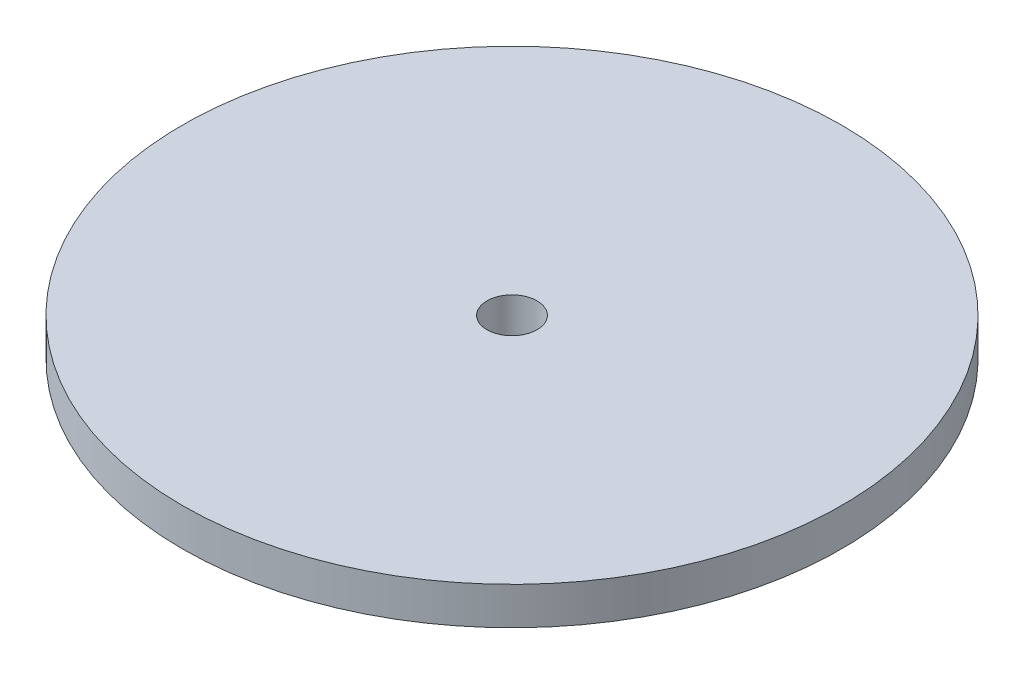
ISO-10303-21;
HEADER;
FILE_DESCRIPTION(('STEP AP214'),'2;1');
FILE_NAME('part.step','',(''),(''),'','','');
FILE_SCHEMA(('AUTOMOTIVE_DESIGN { 1 0 10303 214 1 1 1 1 }'));
ENDSEC;
DATA;
#1=APPLICATION_CONTEXT('core data for automotive mechanical design processes');
#2=APPLICATION_PROTOCOL_DEFINITION('international standard','automotive_design',2000,#1);
#3=PRODUCT_CONTEXT('',#1,'mechanical');
#4=PRODUCT('Part','Part','',(#3));
#5=PRODUCT_RELATED_PRODUCT_CATEGORY('part','',(#4));
#6=PRODUCT_DEFINITION_FORMATION('','',#4);
#7=PRODUCT_DEFINITION_CONTEXT('part definition',#1,'design');
#8=PRODUCT_DEFINITION('design','',#6,#7);
#9=PRODUCT_DEFINITION_SHAPE('','',#8);
#10=(LENGTH_UNIT() NAMED_UNIT(*) SI_UNIT(.MILLI.,.METRE.));
#11=(NAMED_UNIT(*) PLANE_ANGLE_UNIT() SI_UNIT($,.RADIAN.));
#12=(NAMED_UNIT(*) SI_UNIT($,.STERADIAN.) SOLID_ANGLE_UNIT());
#13=UNCERTAINTY_MEASURE_WITH_UNIT(LENGTH_MEASURE(1.E-05),#10,'distance_accuracy_value','');
#14=(GEOMETRIC_REPRESENTATION_CONTEXT(3) GLOBAL_UNCERTAINTY_ASSIGNED_CONTEXT((#13)) GLOBAL_UNIT_ASSIGNED_CONTEXT((#10,
#11,#12)) REPRESENTATION_CONTEXT('',''));
#15=CARTESIAN_POINT('',(0.,0.,0.));
#16=DIRECTION('',(0.,0.,1.));
#17=DIRECTION('',(1.,0.,0.));
#18=AXIS2_PLACEMENT_3D('',#15,#16,#17);
#19=CARTESIAN_POINT('',(0.,1.5,0.));
#20=DIRECTION('',(0.,-1.,0.));
#21=DIRECTION('',(0.,0.,-1.));
#22=AXIS2_PLACEMENT_3D('',#19,#20,#21);
#23=CYLINDRICAL_SURFACE('',#22,1.);
#24=CARTESIAN_POINT('',(0.,3.,0.));
#25=DIRECTION('',(0.,1.,0.));
#26=DIRECTION('',(0.,0.,1.));
#27=AXIS2_PLACEMENT_3D('',#24,#25,#26);
#28=CIRCLE('',#27,1.);
#29=CARTESIAN_POINT('',(0.,3.,1.));
#30=VERTEX_POINT('',#29);
#31=EDGE_CURVE('E47',#30,#30,#28,.F.);
#32=ORIENTED_EDGE('',*,*,#31,.F.);
#33=EDGE_LOOP('',(#32));
#34=FACE_BOUND('',#33,.T.);
#35=CARTESIAN_POINT('',(0.,1.5,0.));
#36=DIRECTION('',(0.,-1.,0.));
#37=DIRECTION('',(0.,0.,-1.));
#38=AXIS2_PLACEMENT_3D('',#35,#36,#37);
#39=CIRCLE('',#38,1.);
#40=CARTESIAN_POINT('',(0.,1.5,-1.));
#41=VERTEX_POINT('',#40);
#42=EDGE_CURVE('E42',#41,#41,#39,.T.);
#43=ORIENTED_EDGE('',*,*,#42,.T.);
#44=EDGE_LOOP('',(#43));
#45=FACE_BOUND('',#44,.T.);
#46=ADVANCED_FACE('F39',(#34,#45),#23,.F.);
#47=CARTESIAN_POINT('',(0.,3.,0.));
#48=DIRECTION('',(0.,-1.,0.));
#49=DIRECTION('',(0.,0.,-1.));
#50=AXIS2_PLACEMENT_3D('',#47,#48,#49);
#51=CYLINDRICAL_SURFACE('',#50,13.15);
#52=CARTESIAN_POINT('',(0.,3.,0.));
#53=DIRECTION('',(0.,1.,0.));
#54=DIRECTION('',(0.,0.,1.));
#55=AXIS2_PLACEMENT_3D('',#52,#53,#54);
#56=CIRCLE('',#55,13.15);
#57=CARTESIAN_POINT('',(0.,3.,13.15));
#58=VERTEX_POINT('',#57);
#59=EDGE_CURVE('E10',#58,#58,#56,.T.);
#60=ORIENTED_EDGE('',*,*,#59,.F.);
#61=EDGE_LOOP('',(#60));
#62=FACE_BOUND('',#61,.T.);
#63=CARTESIAN_POINT('',(0.,1.5,0.));
#64=DIRECTION('',(0.,1.,0.));
#65=DIRECTION('',(0.,0.,1.));
#66=AXIS2_PLACEMENT_3D('',#63,#64,#65);
#67=CIRCLE('',#66,13.15);
#68=CARTESIAN_POINT('',(0.,1.5,13.15));
#69=VERTEX_POINT('',#68);
#70=EDGE_CURVE('E53',#69,#69,#67,.T.);
#71=ORIENTED_EDGE('',*,*,#70,.T.);
#72=EDGE_LOOP('',(#71));
#73=FACE_BOUND('',#72,.T.);
#74=ADVANCED_FACE('F72',(#62,#73),#51,.T.);
#75=CARTESIAN_POINT('',(0.,3.,0.));
#76=DIRECTION('',(0.,1.,0.));
#77=DIRECTION('',(0.,0.,1.));
#78=AXIS2_PLACEMENT_3D('',#75,#76,#77);
#79=PLANE('',#78);
#80=ORIENTED_EDGE('',*,*,#31,.T.);
#81=EDGE_LOOP('',(#80));
#82=FACE_BOUND('',#81,.T.);
#83=ORIENTED_EDGE('',*,*,#59,.T.);
#84=EDGE_LOOP('',(#83));
#85=FACE_BOUND('',#84,.T.);
#86=ADVANCED_FACE('F66',(#82,#85),#79,.T.);
#87=CARTESIAN_POINT('',(0.,1.5,0.));
#88=DIRECTION('',(0.,1.,0.));
#89=DIRECTION('',(0.,0.,1.));
#90=AXIS2_PLACEMENT_3D('',#87,#88,#89);
#91=PLANE('',#90);
#92=ORIENTED_EDGE('',*,*,#70,.F.);
#93=EDGE_LOOP('',(#92));
#94=FACE_BOUND('',#93,.T.);
#95=ORIENTED_EDGE('',*,*,#42,.F.);
#96=EDGE_LOOP('',(#95));
#97=FACE_BOUND('',#96,.T.);
#98=ADVANCED_FACE('F64',(#94,#97),#91,.F.);
#99=CLOSED_SHELL('',(#46,#74,#86,#98));
#100=MANIFOLD_SOLID_BREP('B2',#99);
#101=ADVANCED_BREP_SHAPE_REPRESENTATION('',(#18,#100),#14);
#102=SHAPE_DEFINITION_REPRESENTATION(#9,#101);
ENDSEC;
END-ISO-10303-21;
